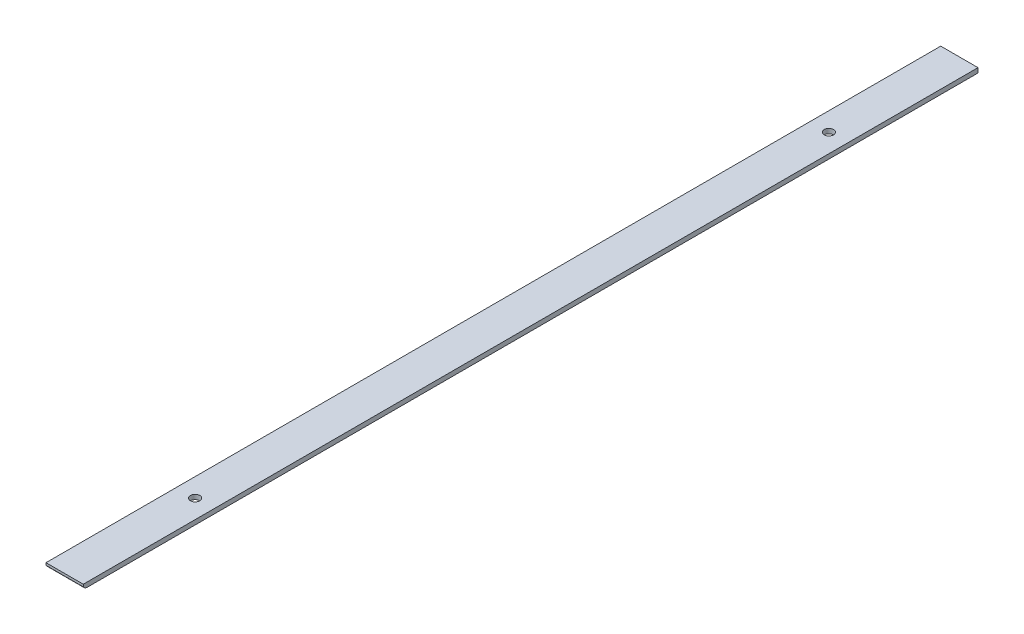
ISO-10303-21;
HEADER;
FILE_DESCRIPTION(('STEP AP214'),'2;1');
FILE_NAME('part.step','',(''),(''),'','','');
FILE_SCHEMA(('AUTOMOTIVE_DESIGN { 1 0 10303 214 1 1 1 1 }'));
ENDSEC;
DATA;
#1=APPLICATION_CONTEXT('core data for automotive mechanical design processes');
#2=APPLICATION_PROTOCOL_DEFINITION('international standard','automotive_design',2000,#1);
#3=PRODUCT_CONTEXT('',#1,'mechanical');
#4=PRODUCT('Part','Part','',(#3));
#5=PRODUCT_RELATED_PRODUCT_CATEGORY('part','',(#4));
#6=PRODUCT_DEFINITION_FORMATION('','',#4);
#7=PRODUCT_DEFINITION_CONTEXT('part definition',#1,'design');
#8=PRODUCT_DEFINITION('design','',#6,#7);
#9=PRODUCT_DEFINITION_SHAPE('','',#8);
#10=(LENGTH_UNIT() NAMED_UNIT(*) SI_UNIT(.MILLI.,.METRE.));
#11=(NAMED_UNIT(*) PLANE_ANGLE_UNIT() SI_UNIT($,.RADIAN.));
#12=(NAMED_UNIT(*) SI_UNIT($,.STERADIAN.) SOLID_ANGLE_UNIT());
#13=UNCERTAINTY_MEASURE_WITH_UNIT(LENGTH_MEASURE(1.E-05),#10,'distance_accuracy_value','');
#14=(GEOMETRIC_REPRESENTATION_CONTEXT(3) GLOBAL_UNCERTAINTY_ASSIGNED_CONTEXT((#13)) GLOBAL_UNIT_ASSIGNED_CONTEXT((#10,
#11,#12)) REPRESENTATION_CONTEXT('',''));
#15=CARTESIAN_POINT('',(0.,0.,0.));
#16=DIRECTION('',(0.,0.,1.));
#17=DIRECTION('',(1.,0.,0.));
#18=AXIS2_PLACEMENT_3D('',#15,#16,#17);
#19=CARTESIAN_POINT('',(25.4,0.,23.5845452561246));
#20=DIRECTION('',(0.,-1.,0.));
#21=DIRECTION('',(0.,0.,-1.));
#22=AXIS2_PLACEMENT_3D('',#19,#20,#21);
#23=PLANE('',#22);
#24=CARTESIAN_POINT('',(12.7,0.,-65.3154547438754));
#25=DIRECTION('',(0.,1.,0.));
#26=DIRECTION('',(0.,0.,1.));
#27=AXIS2_PLACEMENT_3D('',#24,#25,#26);
#28=CIRCLE('',#27,3.175);
#29=CARTESIAN_POINT('',(12.7,0.,-62.1404547438754));
#30=VERTEX_POINT('',#29);
#31=EDGE_CURVE('E144',#30,#30,#28,.T.);
#32=ORIENTED_EDGE('',*,*,#31,.F.);
#33=EDGE_LOOP('',(#32));
#34=FACE_BOUND('',#33,.T.);
#35=CARTESIAN_POINT('',(12.7,0.,-497.115454743875));
#36=DIRECTION('',(0.,1.,0.));
#37=DIRECTION('',(0.,0.,1.));
#38=AXIS2_PLACEMENT_3D('',#35,#36,#37);
#39=CIRCLE('',#38,3.175);
#40=CARTESIAN_POINT('',(12.7,0.,-493.940454743875));
#41=VERTEX_POINT('',#40);
#42=EDGE_CURVE('E147',#41,#41,#39,.T.);
#43=ORIENTED_EDGE('',*,*,#42,.F.);
#44=EDGE_LOOP('',(#43));
#45=FACE_BOUND('',#44,.T.);
#46=DIRECTION('',(0.,0.,1.));
#47=VECTOR('',#46,1.);
#48=CARTESIAN_POINT('',(0.,0.,23.5845452561246));
#49=LINE('',#48,#47);
#50=CARTESIAN_POINT('',(0.,0.,-586.015454743875));
#51=VERTEX_POINT('',#50);
#52=CARTESIAN_POINT('',(0.,0.,23.5845452561246));
#53=VERTEX_POINT('',#52);
#54=EDGE_CURVE('E107',#51,#53,#49,.T.);
#55=ORIENTED_EDGE('',*,*,#54,.T.);
#56=DIRECTION('',(-1.,0.,0.));
#57=VECTOR('',#56,1.);
#58=CARTESIAN_POINT('',(25.4,0.,23.5845452561246));
#59=LINE('',#58,#57);
#60=CARTESIAN_POINT('',(25.4,0.,23.5845452561246));
#61=VERTEX_POINT('',#60);
#62=EDGE_CURVE('E11',#61,#53,#59,.T.);
#63=ORIENTED_EDGE('',*,*,#62,.F.);
#64=DIRECTION('',(0.,0.,1.));
#65=VECTOR('',#64,1.);
#66=CARTESIAN_POINT('',(25.4,0.,23.5845452561246));
#67=LINE('',#66,#65);
#68=CARTESIAN_POINT('',(25.4,0.,-586.015454743875));
#69=VERTEX_POINT('',#68);
#70=EDGE_CURVE('E116',#69,#61,#67,.T.);
#71=ORIENTED_EDGE('',*,*,#70,.F.);
#72=DIRECTION('',(-1.,0.,0.));
#73=VECTOR('',#72,1.);
#74=CARTESIAN_POINT('',(25.4,0.,-586.015454743875));
#75=LINE('',#74,#73);
#76=EDGE_CURVE('E103',#69,#51,#75,.T.);
#77=ORIENTED_EDGE('',*,*,#76,.T.);
#78=EDGE_LOOP('',(#55,#63,#71,#77));
#79=FACE_BOUND('',#78,.T.);
#80=ADVANCED_FACE('F33',(#34,#45,#79),#23,.F.);
#81=CARTESIAN_POINT('',(25.4,0.,23.5845452561246));
#82=DIRECTION('',(0.,0.,-1.));
#83=DIRECTION('',(-1.,0.,0.));
#84=AXIS2_PLACEMENT_3D('',#81,#82,#83);
#85=PLANE('',#84);
#86=DIRECTION('',(0.,-1.,0.));
#87=VECTOR('',#86,1.);
#88=CARTESIAN_POINT('',(0.,0.,23.5845452561246));
#89=LINE('',#88,#87);
#90=CARTESIAN_POINT('',(0.,-1.5875,23.5845452561246));
#91=VERTEX_POINT('',#90);
#92=EDGE_CURVE('E110',#53,#91,#89,.T.);
#93=ORIENTED_EDGE('',*,*,#92,.T.);
#94=DIRECTION('',(-1.,0.,0.));
#95=VECTOR('',#94,1.);
#96=CARTESIAN_POINT('',(25.4,-1.5875,23.5845452561246));
#97=LINE('',#96,#95);
#98=CARTESIAN_POINT('',(25.4,-1.5875,23.5845452561246));
#99=VERTEX_POINT('',#98);
#100=EDGE_CURVE('E41',#99,#91,#97,.T.);
#101=ORIENTED_EDGE('',*,*,#100,.F.);
#102=DIRECTION('',(0.,-1.,0.));
#103=VECTOR('',#102,1.);
#104=CARTESIAN_POINT('',(25.4,0.,23.5845452561246));
#105=LINE('',#104,#103);
#106=EDGE_CURVE('E83',#61,#99,#105,.T.);
#107=ORIENTED_EDGE('',*,*,#106,.F.);
#108=ORIENTED_EDGE('',*,*,#62,.T.);
#109=EDGE_LOOP('',(#93,#101,#107,#108));
#110=FACE_BOUND('',#109,.T.);
#111=ADVANCED_FACE('F136',(#110),#85,.F.);
#112=CARTESIAN_POINT('',(25.4,0.,20.8349145991091));
#113=DIRECTION('',(-1.,0.,0.));
#114=DIRECTION('',(0.,0.,1.));
#115=AXIS2_PLACEMENT_3D('',#112,#113,#114);
#116=CYLINDRICAL_SURFACE('',#115,3.175);
#117=CARTESIAN_POINT('',(0.,0.,20.8349145991091));
#118=DIRECTION('',(1.,0.,0.));
#119=DIRECTION('',(0.,0.,-1.));
#120=AXIS2_PLACEMENT_3D('',#117,#118,#119);
#121=CIRCLE('',#120,3.175);
#122=CARTESIAN_POINT('',(0.,-3.175,20.8349145991091));
#123=VERTEX_POINT('',#122);
#124=EDGE_CURVE('E98',#91,#123,#121,.T.);
#125=ORIENTED_EDGE('',*,*,#124,.T.);
#126=DIRECTION('',(-1.,0.,0.));
#127=VECTOR('',#126,1.);
#128=CARTESIAN_POINT('',(25.4,-3.175,20.8349145991091));
#129=LINE('',#128,#127);
#130=CARTESIAN_POINT('',(25.4,-3.175,20.8349145991091));
#131=VERTEX_POINT('',#130);
#132=EDGE_CURVE('E95',#131,#123,#129,.T.);
#133=ORIENTED_EDGE('',*,*,#132,.F.);
#134=CARTESIAN_POINT('',(25.4,0.,20.8349145991091));
#135=DIRECTION('',(1.,0.,0.));
#136=DIRECTION('',(0.,0.,-1.));
#137=AXIS2_PLACEMENT_3D('',#134,#135,#136);
#138=CIRCLE('',#137,3.175);
#139=EDGE_CURVE('E87',#99,#131,#138,.T.);
#140=ORIENTED_EDGE('',*,*,#139,.F.);
#141=ORIENTED_EDGE('',*,*,#100,.T.);
#142=EDGE_LOOP('',(#125,#133,#140,#141));
#143=FACE_BOUND('',#142,.T.);
#144=ADVANCED_FACE('F96',(#143),#116,.T.);
#145=CARTESIAN_POINT('',(25.4,-3.175,20.8349145991091));
#146=DIRECTION('',(0.,1.,0.));
#147=DIRECTION('',(0.,0.,1.));
#148=AXIS2_PLACEMENT_3D('',#145,#146,#147);
#149=PLANE('',#148);
#150=CARTESIAN_POINT('',(12.7,-3.175,-65.3154547438754));
#151=DIRECTION('',(0.,1.,0.));
#152=DIRECTION('',(0.,0.,1.));
#153=AXIS2_PLACEMENT_3D('',#150,#151,#152);
#154=CIRCLE('',#153,3.175);
#155=CARTESIAN_POINT('',(12.7,-3.175,-62.1404547438754));
#156=VERTEX_POINT('',#155);
#157=EDGE_CURVE('E111',#156,#156,#154,.T.);
#158=ORIENTED_EDGE('',*,*,#157,.T.);
#159=EDGE_LOOP('',(#158));
#160=FACE_BOUND('',#159,.T.);
#161=CARTESIAN_POINT('',(12.7,-3.175,-497.115454743875));
#162=DIRECTION('',(0.,1.,0.));
#163=DIRECTION('',(0.,0.,1.));
#164=AXIS2_PLACEMENT_3D('',#161,#162,#163);
#165=CIRCLE('',#164,3.175);
#166=CARTESIAN_POINT('',(12.7,-3.175,-493.940454743875));
#167=VERTEX_POINT('',#166);
#168=EDGE_CURVE('E149',#167,#167,#165,.T.);
#169=ORIENTED_EDGE('',*,*,#168,.T.);
#170=EDGE_LOOP('',(#169));
#171=FACE_BOUND('',#170,.T.);
#172=DIRECTION('',(0.,0.,-1.));
#173=VECTOR('',#172,1.);
#174=CARTESIAN_POINT('',(0.,-3.175,20.8349145991091));
#175=LINE('',#174,#173);
#176=CARTESIAN_POINT('',(0.,-3.175,-586.015454743875));
#177=VERTEX_POINT('',#176);
#178=EDGE_CURVE('E69',#123,#177,#175,.T.);
#179=ORIENTED_EDGE('',*,*,#178,.T.);
#180=DIRECTION('',(-1.,0.,0.));
#181=VECTOR('',#180,1.);
#182=CARTESIAN_POINT('',(25.4,-3.175,-586.015454743875));
#183=LINE('',#182,#181);
#184=CARTESIAN_POINT('',(25.4,-3.175,-586.015454743875));
#185=VERTEX_POINT('',#184);
#186=EDGE_CURVE('E99',#185,#177,#183,.T.);
#187=ORIENTED_EDGE('',*,*,#186,.F.);
#188=DIRECTION('',(0.,0.,-1.));
#189=VECTOR('',#188,1.);
#190=CARTESIAN_POINT('',(25.4,-3.175,20.8349145991091));
#191=LINE('',#190,#189);
#192=EDGE_CURVE('E91',#131,#185,#191,.T.);
#193=ORIENTED_EDGE('',*,*,#192,.F.);
#194=ORIENTED_EDGE('',*,*,#132,.T.);
#195=EDGE_LOOP('',(#179,#187,#193,#194));
#196=FACE_BOUND('',#195,.T.);
#197=ADVANCED_FACE('F101',(#160,#171,#196),#149,.F.);
#198=CARTESIAN_POINT('',(25.4,0.,-586.015454743875));
#199=DIRECTION('',(0.,0.,1.));
#200=DIRECTION('',(1.,0.,0.));
#201=AXIS2_PLACEMENT_3D('',#198,#199,#200);
#202=PLANE('',#201);
#203=DIRECTION('',(0.,1.,0.));
#204=VECTOR('',#203,1.);
#205=CARTESIAN_POINT('',(0.,0.,-586.015454743875));
#206=LINE('',#205,#204);
#207=EDGE_CURVE('E75',#177,#51,#206,.T.);
#208=ORIENTED_EDGE('',*,*,#207,.T.);
#209=ORIENTED_EDGE('',*,*,#76,.F.);
#210=DIRECTION('',(0.,1.,0.));
#211=VECTOR('',#210,1.);
#212=CARTESIAN_POINT('',(25.4,0.,-586.015454743875));
#213=LINE('',#212,#211);
#214=EDGE_CURVE('E49',#185,#69,#213,.T.);
#215=ORIENTED_EDGE('',*,*,#214,.F.);
#216=ORIENTED_EDGE('',*,*,#186,.T.);
#217=EDGE_LOOP('',(#208,#209,#215,#216));
#218=FACE_BOUND('',#217,.T.);
#219=ADVANCED_FACE('F124',(#218),#202,.F.);
#220=CARTESIAN_POINT('',(25.4,0.,20.8349145991091));
#221=DIRECTION('',(1.,0.,0.));
#222=DIRECTION('',(0.,0.,-1.));
#223=AXIS2_PLACEMENT_3D('',#220,#221,#222);
#224=PLANE('',#223);
#225=ORIENTED_EDGE('',*,*,#70,.T.);
#226=ORIENTED_EDGE('',*,*,#106,.T.);
#227=ORIENTED_EDGE('',*,*,#139,.T.);
#228=ORIENTED_EDGE('',*,*,#192,.T.);
#229=ORIENTED_EDGE('',*,*,#214,.T.);
#230=EDGE_LOOP('',(#225,#226,#227,#228,#229));
#231=FACE_BOUND('',#230,.T.);
#232=ADVANCED_FACE('F89',(#231),#224,.T.);
#233=CARTESIAN_POINT('',(0.,0.,20.8349145991091));
#234=DIRECTION('',(1.,0.,0.));
#235=DIRECTION('',(0.,0.,-1.));
#236=AXIS2_PLACEMENT_3D('',#233,#234,#235);
#237=PLANE('',#236);
#238=ORIENTED_EDGE('',*,*,#54,.F.);
#239=ORIENTED_EDGE('',*,*,#207,.F.);
#240=ORIENTED_EDGE('',*,*,#178,.F.);
#241=ORIENTED_EDGE('',*,*,#124,.F.);
#242=ORIENTED_EDGE('',*,*,#92,.F.);
#243=EDGE_LOOP('',(#238,#239,#240,#241,#242));
#244=FACE_BOUND('',#243,.T.);
#245=ADVANCED_FACE('F120',(#244),#237,.F.);
#246=CARTESIAN_POINT('',(12.7,-3.175,-497.115454743875));
#247=DIRECTION('',(0.,1.,0.));
#248=DIRECTION('',(0.,0.,1.));
#249=AXIS2_PLACEMENT_3D('',#246,#247,#248);
#250=CYLINDRICAL_SURFACE('',#249,3.175);
#251=ORIENTED_EDGE('',*,*,#168,.F.);
#252=EDGE_LOOP('',(#251));
#253=FACE_BOUND('',#252,.T.);
#254=ORIENTED_EDGE('',*,*,#42,.T.);
#255=EDGE_LOOP('',(#254));
#256=FACE_BOUND('',#255,.T.);
#257=ADVANCED_FACE('F163',(#253,#256),#250,.F.);
#258=CARTESIAN_POINT('',(12.7,-3.175,-65.3154547438754));
#259=DIRECTION('',(0.,1.,0.));
#260=DIRECTION('',(0.,0.,1.));
#261=AXIS2_PLACEMENT_3D('',#258,#259,#260);
#262=CYLINDRICAL_SURFACE('',#261,3.175);
#263=ORIENTED_EDGE('',*,*,#157,.F.);
#264=EDGE_LOOP('',(#263));
#265=FACE_BOUND('',#264,.T.);
#266=ORIENTED_EDGE('',*,*,#31,.T.);
#267=EDGE_LOOP('',(#266));
#268=FACE_BOUND('',#267,.T.);
#269=ADVANCED_FACE('F160',(#265,#268),#262,.F.);
#270=CLOSED_SHELL('',(#80,#111,#144,#197,#219,#232,#245,#257,#269));
#271=MANIFOLD_SOLID_BREP('B2',#270);
#272=ADVANCED_BREP_SHAPE_REPRESENTATION('',(#18,#271),#14);
#273=SHAPE_DEFINITION_REPRESENTATION(#9,#272);
ENDSEC;
END-ISO-10303-21;
